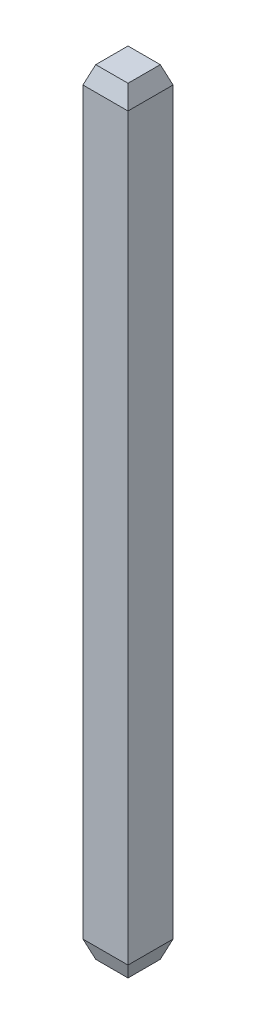
ISO-10303-21;
HEADER;
FILE_DESCRIPTION(('STEP AP214'),'2;1');
FILE_NAME('part.step','',(''),(''),'','','');
FILE_SCHEMA(('AUTOMOTIVE_DESIGN { 1 0 10303 214 1 1 1 1 }'));
ENDSEC;
DATA;
#1=APPLICATION_CONTEXT('core data for automotive mechanical design processes');
#2=APPLICATION_PROTOCOL_DEFINITION('international standard','automotive_design',2000,#1);
#3=PRODUCT_CONTEXT('',#1,'mechanical');
#4=PRODUCT('Part','Part','',(#3));
#5=PRODUCT_RELATED_PRODUCT_CATEGORY('part','',(#4));
#6=PRODUCT_DEFINITION_FORMATION('','',#4);
#7=PRODUCT_DEFINITION_CONTEXT('part definition',#1,'design');
#8=PRODUCT_DEFINITION('design','',#6,#7);
#9=PRODUCT_DEFINITION_SHAPE('','',#8);
#10=(LENGTH_UNIT() NAMED_UNIT(*) SI_UNIT(.MILLI.,.METRE.));
#11=(NAMED_UNIT(*) PLANE_ANGLE_UNIT() SI_UNIT($,.RADIAN.));
#12=(NAMED_UNIT(*) SI_UNIT($,.STERADIAN.) SOLID_ANGLE_UNIT());
#13=UNCERTAINTY_MEASURE_WITH_UNIT(LENGTH_MEASURE(1.E-05),#10,'distance_accuracy_value','');
#14=(GEOMETRIC_REPRESENTATION_CONTEXT(3) GLOBAL_UNCERTAINTY_ASSIGNED_CONTEXT((#13)) GLOBAL_UNIT_ASSIGNED_CONTEXT((#10,
#11,#12)) REPRESENTATION_CONTEXT('',''));
#15=CARTESIAN_POINT('',(0.,0.,0.));
#16=DIRECTION('',(0.,0.,1.));
#17=DIRECTION('',(1.,0.,0.));
#18=AXIS2_PLACEMENT_3D('',#15,#16,#17);
#19=CARTESIAN_POINT('',(0.,11.,0.22900744143345));
#20=DIRECTION('',(0.,0.342020143325667,0.939692620785909));
#21=DIRECTION('',(0.,-0.939692620785909,0.342020143325667));
#22=AXIS2_PLACEMENT_3D('',#19,#20,#21);
#23=PLANE('',#22);
#24=DIRECTION('',(0.323615577118183,-0.889126490715988,0.323615577118186));
#25=VECTOR('',#24,1.);
#26=CARTESIAN_POINT('',(0.22900744143345,11.,0.22900744143345));
#27=LINE('',#26,#25);
#28=CARTESIAN_POINT('',(0.22900744143345,11.,0.229007441433449));
#29=VERTEX_POINT('',#28);
#30=CARTESIAN_POINT('',(0.320000000000001,10.75,0.319999999999999));
#31=VERTEX_POINT('',#30);
#32=EDGE_CURVE('E95',#29,#31,#27,.T.);
#33=ORIENTED_EDGE('',*,*,#32,.F.);
#34=DIRECTION('',(1.,0.,0.));
#35=VECTOR('',#34,1.);
#36=CARTESIAN_POINT('',(0.,11.,0.22900744143345));
#37=LINE('',#36,#35);
#38=CARTESIAN_POINT('',(-0.229007441433452,11.,0.22900744143345));
#39=VERTEX_POINT('',#38);
#40=EDGE_CURVE('E19',#39,#29,#37,.T.);
#41=ORIENTED_EDGE('',*,*,#40,.F.);
#42=DIRECTION('',(0.323615577118182,0.889126490715988,-0.323615577118186));
#43=VECTOR('',#42,1.);
#44=CARTESIAN_POINT('',(-0.320000000000001,10.75,0.32));
#45=LINE('',#44,#43);
#46=CARTESIAN_POINT('',(-0.320000000000001,10.75,0.32));
#47=VERTEX_POINT('',#46);
#48=EDGE_CURVE('E83',#47,#39,#45,.T.);
#49=ORIENTED_EDGE('',*,*,#48,.F.);
#50=DIRECTION('',(-1.,0.,0.));
#51=VECTOR('',#50,1.);
#52=CARTESIAN_POINT('',(-0.320000000000001,10.75,0.32));
#53=LINE('',#52,#51);
#54=EDGE_CURVE('E119',#47,#31,#53,.F.);
#55=ORIENTED_EDGE('',*,*,#54,.T.);
#56=EDGE_LOOP('',(#33,#41,#49,#55));
#57=FACE_BOUND('',#56,.T.);
#58=ADVANCED_FACE('F16',(#57),#23,.T.);
#59=CARTESIAN_POINT('',(-0.320000000000001,0.25,0.32));
#60=DIRECTION('',(0.,0.342020143325667,-0.939692620785909));
#61=DIRECTION('',(0.,0.939692620785909,0.342020143325667));
#62=AXIS2_PLACEMENT_3D('',#59,#60,#61);
#63=PLANE('',#62);
#64=DIRECTION('',(-1.,0.,0.));
#65=VECTOR('',#64,1.);
#66=CARTESIAN_POINT('',(-0.320000000000001,0.25,0.32));
#67=LINE('',#66,#65);
#68=CARTESIAN_POINT('',(0.320000000000001,0.25,0.32));
#69=VERTEX_POINT('',#68);
#70=CARTESIAN_POINT('',(-0.320000000000001,0.25,0.32));
#71=VERTEX_POINT('',#70);
#72=EDGE_CURVE('E121',#69,#71,#67,.T.);
#73=ORIENTED_EDGE('',*,*,#72,.T.);
#74=DIRECTION('',(0.323615577118183,-0.889126490715989,-0.323615577118185));
#75=VECTOR('',#74,1.);
#76=CARTESIAN_POINT('',(-0.320000000000001,0.25,0.32));
#77=LINE('',#76,#75);
#78=CARTESIAN_POINT('',(-0.229007441433451,0.,0.22900744143345));
#79=VERTEX_POINT('',#78);
#80=EDGE_CURVE('E77',#71,#79,#77,.T.);
#81=ORIENTED_EDGE('',*,*,#80,.T.);
#82=DIRECTION('',(1.,0.,0.));
#83=VECTOR('',#82,1.);
#84=CARTESIAN_POINT('',(0.,0.,0.22900744143345));
#85=LINE('',#84,#83);
#86=CARTESIAN_POINT('',(0.22900744143345,0.,0.22900744143345));
#87=VERTEX_POINT('',#86);
#88=EDGE_CURVE('E108',#79,#87,#85,.T.);
#89=ORIENTED_EDGE('',*,*,#88,.T.);
#90=DIRECTION('',(0.323615577118183,0.889126490715989,0.323615577118184));
#91=VECTOR('',#90,1.);
#92=CARTESIAN_POINT('',(0.229007441433451,0.,0.22900744143345));
#93=LINE('',#92,#91);
#94=EDGE_CURVE('E116',#87,#69,#93,.T.);
#95=ORIENTED_EDGE('',*,*,#94,.T.);
#96=EDGE_LOOP('',(#73,#81,#89,#95));
#97=FACE_BOUND('',#96,.T.);
#98=ADVANCED_FACE('F212',(#97),#63,.F.);
#99=CARTESIAN_POINT('',(0.,11.,0.));
#100=DIRECTION('',(0.,1.,0.));
#101=DIRECTION('',(0.,0.,1.));
#102=AXIS2_PLACEMENT_3D('',#99,#100,#101);
#103=PLANE('',#102);
#104=DIRECTION('',(1.,0.,0.));
#105=VECTOR('',#104,1.);
#106=CARTESIAN_POINT('',(0.,11.,-0.22900744143345));
#107=LINE('',#106,#105);
#108=CARTESIAN_POINT('',(-0.229007441433452,11.,-0.22900744143345));
#109=VERTEX_POINT('',#108);
#110=CARTESIAN_POINT('',(0.22900744143345,11.,-0.22900744143345));
#111=VERTEX_POINT('',#110);
#112=EDGE_CURVE('E101',#109,#111,#107,.T.);
#113=ORIENTED_EDGE('',*,*,#112,.F.);
#114=DIRECTION('',(0.,0.,1.));
#115=VECTOR('',#114,1.);
#116=CARTESIAN_POINT('',(-0.229007441433452,11.,0.));
#117=LINE('',#116,#115);
#118=EDGE_CURVE('E88',#39,#109,#117,.F.);
#119=ORIENTED_EDGE('',*,*,#118,.F.);
#120=ORIENTED_EDGE('',*,*,#40,.T.);
#121=DIRECTION('',(0.,0.,1.));
#122=VECTOR('',#121,1.);
#123=CARTESIAN_POINT('',(0.22900744143345,11.,0.));
#124=LINE('',#123,#122);
#125=EDGE_CURVE('E111',#111,#29,#124,.T.);
#126=ORIENTED_EDGE('',*,*,#125,.F.);
#127=EDGE_LOOP('',(#113,#119,#120,#126));
#128=FACE_BOUND('',#127,.T.);
#129=ADVANCED_FACE('F100',(#128),#103,.T.);
#130=CARTESIAN_POINT('',(-0.229007441433452,11.,0.));
#131=DIRECTION('',(-0.939692620785909,0.342020143325667,0.));
#132=DIRECTION('',(-0.342020143325667,-0.939692620785909,0.));
#133=AXIS2_PLACEMENT_3D('',#130,#131,#132);
#134=PLANE('',#133);
#135=ORIENTED_EDGE('',*,*,#48,.T.);
#136=ORIENTED_EDGE('',*,*,#118,.T.);
#137=DIRECTION('',(0.323615577118181,0.88912649071599,0.323615577118183));
#138=VECTOR('',#137,1.);
#139=CARTESIAN_POINT('',(-0.320000000000001,10.75,-0.319999999999999));
#140=LINE('',#139,#138);
#141=CARTESIAN_POINT('',(-0.320000000000001,10.75,-0.32));
#142=VERTEX_POINT('',#141);
#143=EDGE_CURVE('E123',#142,#109,#140,.T.);
#144=ORIENTED_EDGE('',*,*,#143,.F.);
#145=DIRECTION('',(0.,0.,-1.));
#146=VECTOR('',#145,1.);
#147=CARTESIAN_POINT('',(-0.320000000000001,10.75,-0.32));
#148=LINE('',#147,#146);
#149=EDGE_CURVE('E90',#142,#47,#148,.F.);
#150=ORIENTED_EDGE('',*,*,#149,.T.);
#151=EDGE_LOOP('',(#135,#136,#144,#150));
#152=FACE_BOUND('',#151,.T.);
#153=ADVANCED_FACE('F85',(#152),#134,.T.);
#154=CARTESIAN_POINT('',(-0.320000000000001,0.25,-0.32));
#155=DIRECTION('',(0.939692620785909,0.342020143325667,0.));
#156=DIRECTION('',(-0.342020143325667,0.939692620785909,0.));
#157=AXIS2_PLACEMENT_3D('',#154,#155,#156);
#158=PLANE('',#157);
#159=DIRECTION('',(0.,0.,1.));
#160=VECTOR('',#159,1.);
#161=CARTESIAN_POINT('',(-0.229007441433452,0.,0.));
#162=LINE('',#161,#160);
#163=CARTESIAN_POINT('',(-0.229007441433452,0.,-0.22900744143345));
#164=VERTEX_POINT('',#163);
#165=EDGE_CURVE('E103',#164,#79,#162,.T.);
#166=ORIENTED_EDGE('',*,*,#165,.T.);
#167=ORIENTED_EDGE('',*,*,#80,.F.);
#168=DIRECTION('',(0.,0.,-1.));
#169=VECTOR('',#168,1.);
#170=CARTESIAN_POINT('',(-0.320000000000001,0.25,-0.32));
#171=LINE('',#170,#169);
#172=CARTESIAN_POINT('',(-0.320000000000001,0.25,-0.32));
#173=VERTEX_POINT('',#172);
#174=EDGE_CURVE('E132',#71,#173,#171,.T.);
#175=ORIENTED_EDGE('',*,*,#174,.T.);
#176=DIRECTION('',(0.323615577118179,-0.889126490715991,0.323615577118183));
#177=VECTOR('',#176,1.);
#178=CARTESIAN_POINT('',(-0.320000000000001,0.25,-0.32));
#179=LINE('',#178,#177);
#180=EDGE_CURVE('E135',#173,#164,#179,.T.);
#181=ORIENTED_EDGE('',*,*,#180,.T.);
#182=EDGE_LOOP('',(#166,#167,#175,#181));
#183=FACE_BOUND('',#182,.T.);
#184=ADVANCED_FACE('F204',(#183),#158,.F.);
#185=CARTESIAN_POINT('',(0.,0.,0.));
#186=DIRECTION('',(0.,1.,0.));
#187=DIRECTION('',(0.,0.,1.));
#188=AXIS2_PLACEMENT_3D('',#185,#186,#187);
#189=PLANE('',#188);
#190=ORIENTED_EDGE('',*,*,#165,.F.);
#191=DIRECTION('',(1.,0.,0.));
#192=VECTOR('',#191,1.);
#193=CARTESIAN_POINT('',(0.320000000000001,0.,-0.22900744143345));
#194=LINE('',#193,#192);
#195=CARTESIAN_POINT('',(0.22900744143345,0.,-0.22900744143345));
#196=VERTEX_POINT('',#195);
#197=EDGE_CURVE('E138',#164,#196,#194,.T.);
#198=ORIENTED_EDGE('',*,*,#197,.T.);
#199=DIRECTION('',(0.,0.,1.));
#200=VECTOR('',#199,1.);
#201=CARTESIAN_POINT('',(0.229007441433451,0.,0.32));
#202=LINE('',#201,#200);
#203=EDGE_CURVE('E113',#196,#87,#202,.T.);
#204=ORIENTED_EDGE('',*,*,#203,.T.);
#205=ORIENTED_EDGE('',*,*,#88,.F.);
#206=EDGE_LOOP('',(#190,#198,#204,#205));
#207=FACE_BOUND('',#206,.T.);
#208=ADVANCED_FACE('F201',(#207),#189,.F.);
#209=CARTESIAN_POINT('',(0.22900744143345,11.,0.));
#210=DIRECTION('',(0.939692620785909,0.342020143325667,0.));
#211=DIRECTION('',(-0.342020143325667,0.939692620785909,0.));
#212=AXIS2_PLACEMENT_3D('',#209,#210,#211);
#213=PLANE('',#212);
#214=DIRECTION('',(0.323615577118186,-0.889126490715988,-0.323615577118183));
#215=VECTOR('',#214,1.);
#216=CARTESIAN_POINT('',(0.22900744143345,11.,-0.22900744143345));
#217=LINE('',#216,#215);
#218=CARTESIAN_POINT('',(0.32,10.75,-0.32));
#219=VERTEX_POINT('',#218);
#220=EDGE_CURVE('E126',#111,#219,#217,.T.);
#221=ORIENTED_EDGE('',*,*,#220,.F.);
#222=ORIENTED_EDGE('',*,*,#125,.T.);
#223=ORIENTED_EDGE('',*,*,#32,.T.);
#224=DIRECTION('',(0.,0.,1.));
#225=VECTOR('',#224,1.);
#226=CARTESIAN_POINT('',(0.320000000000001,10.75,0.32));
#227=LINE('',#226,#225);
#228=EDGE_CURVE('E143',#31,#219,#227,.F.);
#229=ORIENTED_EDGE('',*,*,#228,.T.);
#230=EDGE_LOOP('',(#221,#222,#223,#229));
#231=FACE_BOUND('',#230,.T.);
#232=ADVANCED_FACE('F175',(#231),#213,.T.);
#233=CARTESIAN_POINT('',(0.320000000000001,0.25,0.32));
#234=DIRECTION('',(-0.939692620785909,0.342020143325667,0.));
#235=DIRECTION('',(-0.342020143325667,-0.939692620785909,0.));
#236=AXIS2_PLACEMENT_3D('',#233,#234,#235);
#237=PLANE('',#236);
#238=ORIENTED_EDGE('',*,*,#203,.F.);
#239=DIRECTION('',(0.323615577118184,0.889126490715989,-0.323615577118183));
#240=VECTOR('',#239,1.);
#241=CARTESIAN_POINT('',(0.22900744143345,0.,-0.22900744143345));
#242=LINE('',#241,#240);
#243=CARTESIAN_POINT('',(0.320000000000001,0.25,-0.32));
#244=VERTEX_POINT('',#243);
#245=EDGE_CURVE('E141',#196,#244,#242,.T.);
#246=ORIENTED_EDGE('',*,*,#245,.T.);
#247=DIRECTION('',(0.,0.,1.));
#248=VECTOR('',#247,1.);
#249=CARTESIAN_POINT('',(0.320000000000001,0.25,0.32));
#250=LINE('',#249,#248);
#251=EDGE_CURVE('E33',#244,#69,#250,.T.);
#252=ORIENTED_EDGE('',*,*,#251,.T.);
#253=ORIENTED_EDGE('',*,*,#94,.F.);
#254=EDGE_LOOP('',(#238,#246,#252,#253));
#255=FACE_BOUND('',#254,.T.);
#256=ADVANCED_FACE('F194',(#255),#237,.F.);
#257=CARTESIAN_POINT('',(-0.320000000000001,11.,0.32));
#258=DIRECTION('',(0.,0.,-1.));
#259=DIRECTION('',(-1.,0.,0.));
#260=AXIS2_PLACEMENT_3D('',#257,#258,#259);
#261=PLANE('',#260);
#262=ORIENTED_EDGE('',*,*,#72,.F.);
#263=DIRECTION('',(0.,1.,0.));
#264=VECTOR('',#263,1.);
#265=CARTESIAN_POINT('',(0.320000000000001,11.,0.32));
#266=LINE('',#265,#264);
#267=EDGE_CURVE('E147',#69,#31,#266,.T.);
#268=ORIENTED_EDGE('',*,*,#267,.T.);
#269=ORIENTED_EDGE('',*,*,#54,.F.);
#270=DIRECTION('',(0.,1.,0.));
#271=VECTOR('',#270,1.);
#272=CARTESIAN_POINT('',(-0.320000000000001,11.,0.32));
#273=LINE('',#272,#271);
#274=EDGE_CURVE('E129',#47,#71,#273,.F.);
#275=ORIENTED_EDGE('',*,*,#274,.T.);
#276=EDGE_LOOP('',(#262,#268,#269,#275));
#277=FACE_BOUND('',#276,.T.);
#278=ADVANCED_FACE('F191',(#277),#261,.F.);
#279=CARTESIAN_POINT('',(0.,11.,-0.22900744143345));
#280=DIRECTION('',(0.,0.342020143325667,-0.939692620785909));
#281=DIRECTION('',(0.,0.939692620785909,0.342020143325667));
#282=AXIS2_PLACEMENT_3D('',#279,#280,#281);
#283=PLANE('',#282);
#284=ORIENTED_EDGE('',*,*,#220,.T.);
#285=DIRECTION('',(1.,0.,0.));
#286=VECTOR('',#285,1.);
#287=CARTESIAN_POINT('',(0.320000000000001,10.75,-0.32));
#288=LINE('',#287,#286);
#289=EDGE_CURVE('E150',#219,#142,#288,.F.);
#290=ORIENTED_EDGE('',*,*,#289,.T.);
#291=ORIENTED_EDGE('',*,*,#143,.T.);
#292=ORIENTED_EDGE('',*,*,#112,.T.);
#293=EDGE_LOOP('',(#284,#290,#291,#292));
#294=FACE_BOUND('',#293,.T.);
#295=ADVANCED_FACE('F171',(#294),#283,.T.);
#296=CARTESIAN_POINT('',(-0.320000000000001,11.,-0.32));
#297=DIRECTION('',(1.,0.,0.));
#298=DIRECTION('',(0.,0.,-1.));
#299=AXIS2_PLACEMENT_3D('',#296,#297,#298);
#300=PLANE('',#299);
#301=ORIENTED_EDGE('',*,*,#174,.F.);
#302=ORIENTED_EDGE('',*,*,#274,.F.);
#303=ORIENTED_EDGE('',*,*,#149,.F.);
#304=DIRECTION('',(0.,1.,0.));
#305=VECTOR('',#304,1.);
#306=CARTESIAN_POINT('',(-0.320000000000001,11.,-0.32));
#307=LINE('',#306,#305);
#308=EDGE_CURVE('E153',#142,#173,#307,.F.);
#309=ORIENTED_EDGE('',*,*,#308,.T.);
#310=EDGE_LOOP('',(#301,#302,#303,#309));
#311=FACE_BOUND('',#310,.T.);
#312=ADVANCED_FACE('F169',(#311),#300,.F.);
#313=CARTESIAN_POINT('',(0.320000000000001,0.25,-0.32));
#314=DIRECTION('',(0.,0.342020143325667,0.939692620785909));
#315=DIRECTION('',(0.,-0.939692620785909,0.342020143325667));
#316=AXIS2_PLACEMENT_3D('',#313,#314,#315);
#317=PLANE('',#316);
#318=ORIENTED_EDGE('',*,*,#197,.F.);
#319=ORIENTED_EDGE('',*,*,#180,.F.);
#320=DIRECTION('',(1.,0.,0.));
#321=VECTOR('',#320,1.);
#322=CARTESIAN_POINT('',(0.320000000000001,0.25,-0.32));
#323=LINE('',#322,#321);
#324=EDGE_CURVE('E25',#173,#244,#323,.T.);
#325=ORIENTED_EDGE('',*,*,#324,.T.);
#326=ORIENTED_EDGE('',*,*,#245,.F.);
#327=EDGE_LOOP('',(#318,#319,#325,#326));
#328=FACE_BOUND('',#327,.T.);
#329=ADVANCED_FACE('F161',(#328),#317,.F.);
#330=CARTESIAN_POINT('',(0.320000000000001,11.,0.32));
#331=DIRECTION('',(-1.,0.,0.));
#332=DIRECTION('',(0.,0.,1.));
#333=AXIS2_PLACEMENT_3D('',#330,#331,#332);
#334=PLANE('',#333);
#335=ORIENTED_EDGE('',*,*,#251,.F.);
#336=DIRECTION('',(0.,1.,0.));
#337=VECTOR('',#336,1.);
#338=CARTESIAN_POINT('',(0.320000000000001,11.,-0.32));
#339=LINE('',#338,#337);
#340=EDGE_CURVE('E10',#244,#219,#339,.T.);
#341=ORIENTED_EDGE('',*,*,#340,.T.);
#342=ORIENTED_EDGE('',*,*,#228,.F.);
#343=ORIENTED_EDGE('',*,*,#267,.F.);
#344=EDGE_LOOP('',(#335,#341,#342,#343));
#345=FACE_BOUND('',#344,.T.);
#346=ADVANCED_FACE('F176',(#345),#334,.F.);
#347=CARTESIAN_POINT('',(0.320000000000001,11.,-0.32));
#348=DIRECTION('',(0.,0.,1.));
#349=DIRECTION('',(1.,0.,0.));
#350=AXIS2_PLACEMENT_3D('',#347,#348,#349);
#351=PLANE('',#350);
#352=ORIENTED_EDGE('',*,*,#324,.F.);
#353=ORIENTED_EDGE('',*,*,#308,.F.);
#354=ORIENTED_EDGE('',*,*,#289,.F.);
#355=ORIENTED_EDGE('',*,*,#340,.F.);
#356=EDGE_LOOP('',(#352,#353,#354,#355));
#357=FACE_BOUND('',#356,.T.);
#358=ADVANCED_FACE('F165',(#357),#351,.F.);
#359=CLOSED_SHELL('',(#58,#98,#129,#153,#184,#208,#232,#256,#278,#295,#312,#329,#346,#358));
#360=MANIFOLD_SOLID_BREP('B1',#359);
#361=ADVANCED_BREP_SHAPE_REPRESENTATION('',(#18,#360),#14);
#362=SHAPE_DEFINITION_REPRESENTATION(#9,#361);
ENDSEC;
END-ISO-10303-21;
